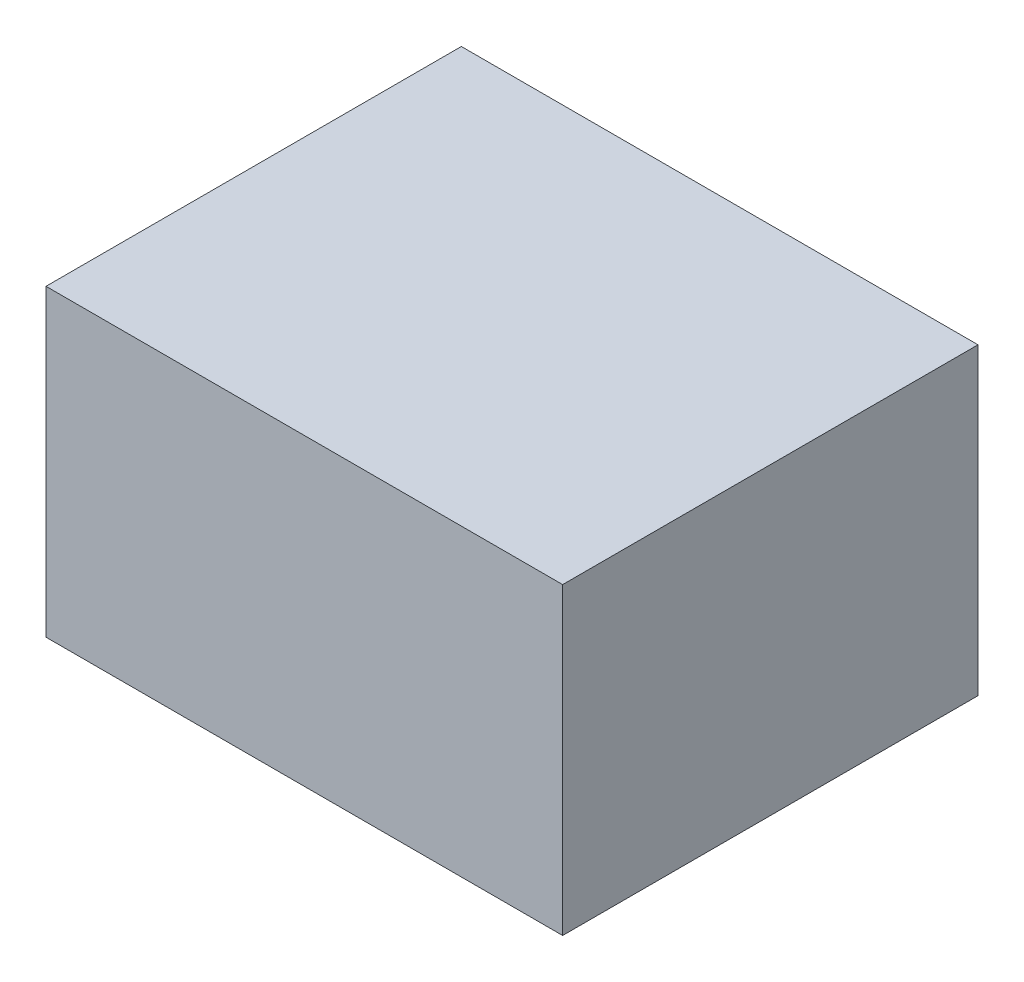
ISO-10303-21;
HEADER;
FILE_DESCRIPTION(('STEP AP214'),'2;1');
FILE_NAME('part.step','',(''),(''),'','','');
FILE_SCHEMA(('AUTOMOTIVE_DESIGN { 1 0 10303 214 1 1 1 1 }'));
ENDSEC;
DATA;
#1=APPLICATION_CONTEXT('core data for automotive mechanical design processes');
#2=APPLICATION_PROTOCOL_DEFINITION('international standard','automotive_design',2000,#1);
#3=PRODUCT_CONTEXT('',#1,'mechanical');
#4=PRODUCT('Part','Part','',(#3));
#5=PRODUCT_RELATED_PRODUCT_CATEGORY('part','',(#4));
#6=PRODUCT_DEFINITION_FORMATION('','',#4);
#7=PRODUCT_DEFINITION_CONTEXT('part definition',#1,'design');
#8=PRODUCT_DEFINITION('design','',#6,#7);
#9=PRODUCT_DEFINITION_SHAPE('','',#8);
#10=(LENGTH_UNIT() NAMED_UNIT(*) SI_UNIT(.MILLI.,.METRE.));
#11=(NAMED_UNIT(*) PLANE_ANGLE_UNIT() SI_UNIT($,.RADIAN.));
#12=(NAMED_UNIT(*) SI_UNIT($,.STERADIAN.) SOLID_ANGLE_UNIT());
#13=UNCERTAINTY_MEASURE_WITH_UNIT(LENGTH_MEASURE(1.E-05),#10,'distance_accuracy_value','');
#14=(GEOMETRIC_REPRESENTATION_CONTEXT(3) GLOBAL_UNCERTAINTY_ASSIGNED_CONTEXT((#13)) GLOBAL_UNIT_ASSIGNED_CONTEXT((#10,
#11,#12)) REPRESENTATION_CONTEXT('',''));
#15=CARTESIAN_POINT('',(0.,0.,0.));
#16=DIRECTION('',(0.,0.,1.));
#17=DIRECTION('',(1.,0.,0.));
#18=AXIS2_PLACEMENT_3D('',#15,#16,#17);
#19=CARTESIAN_POINT('',(0.,0.,0.));
#20=DIRECTION('',(0.,1.,0.));
#21=DIRECTION('',(0.,0.,1.));
#22=AXIS2_PLACEMENT_3D('',#19,#20,#21);
#23=PLANE('',#22);
#24=DIRECTION('',(0.,0.,-1.));
#25=VECTOR('',#24,1.);
#26=CARTESIAN_POINT('',(102.,0.,-81.9999999999999));
#27=LINE('',#26,#25);
#28=CARTESIAN_POINT('',(102.,0.,82.));
#29=VERTEX_POINT('',#28);
#30=CARTESIAN_POINT('',(102.,0.,-81.9999999999999));
#31=VERTEX_POINT('',#30);
#32=EDGE_CURVE('E143',#29,#31,#27,.T.);
#33=ORIENTED_EDGE('',*,*,#32,.F.);
#34=DIRECTION('',(1.,0.,0.));
#35=VECTOR('',#34,1.);
#36=CARTESIAN_POINT('',(-102.,0.,82.));
#37=LINE('',#36,#35);
#38=CARTESIAN_POINT('',(-102.,0.,82.));
#39=VERTEX_POINT('',#38);
#40=EDGE_CURVE('E91',#39,#29,#37,.T.);
#41=ORIENTED_EDGE('',*,*,#40,.F.);
#42=DIRECTION('',(0.,0.,1.));
#43=VECTOR('',#42,1.);
#44=CARTESIAN_POINT('',(-102.,0.,-81.9999999999999));
#45=LINE('',#44,#43);
#46=CARTESIAN_POINT('',(-102.,0.,-81.9999999999999));
#47=VERTEX_POINT('',#46);
#48=EDGE_CURVE('E168',#47,#39,#45,.T.);
#49=ORIENTED_EDGE('',*,*,#48,.F.);
#50=DIRECTION('',(-1.,0.,0.));
#51=VECTOR('',#50,1.);
#52=CARTESIAN_POINT('',(-102.,0.,-81.9999999999999));
#53=LINE('',#52,#51);
#54=EDGE_CURVE('E149',#31,#47,#53,.T.);
#55=ORIENTED_EDGE('',*,*,#54,.F.);
#56=EDGE_LOOP('',(#33,#41,#49,#55));
#57=FACE_BOUND('',#56,.T.);
#58=DIRECTION('',(0.,0.,-1.));
#59=VECTOR('',#58,1.);
#60=CARTESIAN_POINT('',(100.,0.,-80.));
#61=LINE('',#60,#59);
#62=CARTESIAN_POINT('',(100.,0.,80.));
#63=VERTEX_POINT('',#62);
#64=CARTESIAN_POINT('',(100.,0.,-80.));
#65=VERTEX_POINT('',#64);
#66=EDGE_CURVE('E61',#63,#65,#61,.T.);
#67=ORIENTED_EDGE('',*,*,#66,.T.);
#68=DIRECTION('',(-1.,0.,0.));
#69=VECTOR('',#68,1.);
#70=CARTESIAN_POINT('',(-100.,0.,-80.));
#71=LINE('',#70,#69);
#72=CARTESIAN_POINT('',(-100.,0.,-80.));
#73=VERTEX_POINT('',#72);
#74=EDGE_CURVE('E141',#65,#73,#71,.T.);
#75=ORIENTED_EDGE('',*,*,#74,.T.);
#76=DIRECTION('',(0.,0.,1.));
#77=VECTOR('',#76,1.);
#78=CARTESIAN_POINT('',(-100.,0.,-80.));
#79=LINE('',#78,#77);
#80=CARTESIAN_POINT('',(-100.,0.,80.));
#81=VERTEX_POINT('',#80);
#82=EDGE_CURVE('E288',#73,#81,#79,.T.);
#83=ORIENTED_EDGE('',*,*,#82,.T.);
#84=DIRECTION('',(1.,0.,0.));
#85=VECTOR('',#84,1.);
#86=CARTESIAN_POINT('',(-100.,0.,80.));
#87=LINE('',#86,#85);
#88=EDGE_CURVE('E137',#81,#63,#87,.T.);
#89=ORIENTED_EDGE('',*,*,#88,.T.);
#90=EDGE_LOOP('',(#67,#75,#83,#89));
#91=FACE_BOUND('',#90,.T.);
#92=ADVANCED_FACE('F45',(#57,#91),#23,.F.);
#93=CARTESIAN_POINT('',(102.,120.,-81.9999999999999));
#94=DIRECTION('',(-1.,0.,0.));
#95=DIRECTION('',(0.,0.,1.));
#96=AXIS2_PLACEMENT_3D('',#93,#94,#95);
#97=PLANE('',#96);
#98=ORIENTED_EDGE('',*,*,#32,.T.);
#99=DIRECTION('',(0.,-1.,0.));
#100=VECTOR('',#99,1.);
#101=CARTESIAN_POINT('',(102.,120.,-81.9999999999999));
#102=LINE('',#101,#100);
#103=CARTESIAN_POINT('',(102.,120.,-81.9999999999999));
#104=VERTEX_POINT('',#103);
#105=EDGE_CURVE('E11',#104,#31,#102,.T.);
#106=ORIENTED_EDGE('',*,*,#105,.F.);
#107=DIRECTION('',(0.,0.,-1.));
#108=VECTOR('',#107,1.);
#109=CARTESIAN_POINT('',(102.,120.,-81.9999999999999));
#110=LINE('',#109,#108);
#111=CARTESIAN_POINT('',(102.,120.,82.));
#112=VERTEX_POINT('',#111);
#113=EDGE_CURVE('E155',#112,#104,#110,.T.);
#114=ORIENTED_EDGE('',*,*,#113,.F.);
#115=DIRECTION('',(0.,-1.,0.));
#116=VECTOR('',#115,1.);
#117=CARTESIAN_POINT('',(102.,120.,82.));
#118=LINE('',#117,#116);
#119=EDGE_CURVE('E164',#112,#29,#118,.T.);
#120=ORIENTED_EDGE('',*,*,#119,.T.);
#121=EDGE_LOOP('',(#98,#106,#114,#120));
#122=FACE_BOUND('',#121,.T.);
#123=ADVANCED_FACE('F47',(#122),#97,.F.);
#124=CARTESIAN_POINT('',(-102.,120.,-81.9999999999999));
#125=DIRECTION('',(0.,0.,1.));
#126=DIRECTION('',(1.,0.,0.));
#127=AXIS2_PLACEMENT_3D('',#124,#125,#126);
#128=PLANE('',#127);
#129=ORIENTED_EDGE('',*,*,#54,.T.);
#130=DIRECTION('',(0.,-1.,0.));
#131=VECTOR('',#130,1.);
#132=CARTESIAN_POINT('',(-102.,120.,-81.9999999999999));
#133=LINE('',#132,#131);
#134=CARTESIAN_POINT('',(-102.,120.,-81.9999999999999));
#135=VERTEX_POINT('',#134);
#136=EDGE_CURVE('E54',#135,#47,#133,.T.);
#137=ORIENTED_EDGE('',*,*,#136,.F.);
#138=DIRECTION('',(-1.,0.,0.));
#139=VECTOR('',#138,1.);
#140=CARTESIAN_POINT('',(-102.,120.,-81.9999999999999));
#141=LINE('',#140,#139);
#142=EDGE_CURVE('E98',#104,#135,#141,.T.);
#143=ORIENTED_EDGE('',*,*,#142,.F.);
#144=ORIENTED_EDGE('',*,*,#105,.T.);
#145=EDGE_LOOP('',(#129,#137,#143,#144));
#146=FACE_BOUND('',#145,.T.);
#147=ADVANCED_FACE('F199',(#146),#128,.F.);
#148=CARTESIAN_POINT('',(-102.,120.,-81.9999999999999));
#149=DIRECTION('',(1.,0.,0.));
#150=DIRECTION('',(0.,0.,-1.));
#151=AXIS2_PLACEMENT_3D('',#148,#149,#150);
#152=PLANE('',#151);
#153=ORIENTED_EDGE('',*,*,#48,.T.);
#154=DIRECTION('',(0.,-1.,0.));
#155=VECTOR('',#154,1.);
#156=CARTESIAN_POINT('',(-102.,120.,82.));
#157=LINE('',#156,#155);
#158=CARTESIAN_POINT('',(-102.,120.,82.));
#159=VERTEX_POINT('',#158);
#160=EDGE_CURVE('E175',#159,#39,#157,.T.);
#161=ORIENTED_EDGE('',*,*,#160,.F.);
#162=DIRECTION('',(0.,0.,1.));
#163=VECTOR('',#162,1.);
#164=CARTESIAN_POINT('',(-102.,120.,-81.9999999999999));
#165=LINE('',#164,#163);
#166=EDGE_CURVE('E160',#135,#159,#165,.T.);
#167=ORIENTED_EDGE('',*,*,#166,.F.);
#168=ORIENTED_EDGE('',*,*,#136,.T.);
#169=EDGE_LOOP('',(#153,#161,#167,#168));
#170=FACE_BOUND('',#169,.T.);
#171=ADVANCED_FACE('F182',(#170),#152,.F.);
#172=CARTESIAN_POINT('',(-102.,120.,82.));
#173=DIRECTION('',(0.,0.,-1.));
#174=DIRECTION('',(-1.,0.,0.));
#175=AXIS2_PLACEMENT_3D('',#172,#173,#174);
#176=PLANE('',#175);
#177=ORIENTED_EDGE('',*,*,#40,.T.);
#178=ORIENTED_EDGE('',*,*,#119,.F.);
#179=DIRECTION('',(1.,0.,0.));
#180=VECTOR('',#179,1.);
#181=CARTESIAN_POINT('',(-102.,120.,82.));
#182=LINE('',#181,#180);
#183=EDGE_CURVE('E70',#159,#112,#182,.T.);
#184=ORIENTED_EDGE('',*,*,#183,.F.);
#185=ORIENTED_EDGE('',*,*,#160,.T.);
#186=EDGE_LOOP('',(#177,#178,#184,#185));
#187=FACE_BOUND('',#186,.T.);
#188=ADVANCED_FACE('F190',(#187),#176,.F.);
#189=CARTESIAN_POINT('',(0.,120.,0.));
#190=DIRECTION('',(0.,1.,0.));
#191=DIRECTION('',(0.,0.,1.));
#192=AXIS2_PLACEMENT_3D('',#189,#190,#191);
#193=PLANE('',#192);
#194=ORIENTED_EDGE('',*,*,#113,.T.);
#195=ORIENTED_EDGE('',*,*,#142,.T.);
#196=ORIENTED_EDGE('',*,*,#166,.T.);
#197=ORIENTED_EDGE('',*,*,#183,.T.);
#198=EDGE_LOOP('',(#194,#195,#196,#197));
#199=FACE_BOUND('',#198,.T.);
#200=ADVANCED_FACE('F192',(#199),#193,.T.);
#201=CARTESIAN_POINT('',(100.,116.,-80.));
#202=DIRECTION('',(-1.,0.,0.));
#203=DIRECTION('',(0.,0.,1.));
#204=AXIS2_PLACEMENT_3D('',#201,#202,#203);
#205=PLANE('',#204);
#206=ORIENTED_EDGE('',*,*,#66,.F.);
#207=DIRECTION('',(0.,-1.,0.));
#208=VECTOR('',#207,1.);
#209=CARTESIAN_POINT('',(100.,116.,80.));
#210=LINE('',#209,#208);
#211=CARTESIAN_POINT('',(100.,116.,80.));
#212=VERTEX_POINT('',#211);
#213=EDGE_CURVE('E135',#212,#63,#210,.T.);
#214=ORIENTED_EDGE('',*,*,#213,.F.);
#215=DIRECTION('',(0.,0.,-1.));
#216=VECTOR('',#215,1.);
#217=CARTESIAN_POINT('',(100.,116.,-80.));
#218=LINE('',#217,#216);
#219=CARTESIAN_POINT('',(100.,116.,-80.));
#220=VERTEX_POINT('',#219);
#221=EDGE_CURVE('E126',#212,#220,#218,.T.);
#222=ORIENTED_EDGE('',*,*,#221,.T.);
#223=DIRECTION('',(0.,-1.,0.));
#224=VECTOR('',#223,1.);
#225=CARTESIAN_POINT('',(100.,116.,-80.));
#226=LINE('',#225,#224);
#227=EDGE_CURVE('E134',#220,#65,#226,.T.);
#228=ORIENTED_EDGE('',*,*,#227,.T.);
#229=EDGE_LOOP('',(#206,#214,#222,#228));
#230=FACE_BOUND('',#229,.T.);
#231=ADVANCED_FACE('F133',(#230),#205,.T.);
#232=CARTESIAN_POINT('',(-100.,116.,-80.));
#233=DIRECTION('',(0.,0.,1.));
#234=DIRECTION('',(1.,0.,0.));
#235=AXIS2_PLACEMENT_3D('',#232,#233,#234);
#236=PLANE('',#235);
#237=ORIENTED_EDGE('',*,*,#74,.F.);
#238=ORIENTED_EDGE('',*,*,#227,.F.);
#239=DIRECTION('',(-1.,0.,0.));
#240=VECTOR('',#239,1.);
#241=CARTESIAN_POINT('',(-100.,116.,-80.));
#242=LINE('',#241,#240);
#243=CARTESIAN_POINT('',(-100.,116.,-80.));
#244=VERTEX_POINT('',#243);
#245=EDGE_CURVE('E122',#220,#244,#242,.T.);
#246=ORIENTED_EDGE('',*,*,#245,.T.);
#247=DIRECTION('',(0.,-1.,0.));
#248=VECTOR('',#247,1.);
#249=CARTESIAN_POINT('',(-100.,116.,-80.));
#250=LINE('',#249,#248);
#251=EDGE_CURVE('E144',#244,#73,#250,.T.);
#252=ORIENTED_EDGE('',*,*,#251,.T.);
#253=EDGE_LOOP('',(#237,#238,#246,#252));
#254=FACE_BOUND('',#253,.T.);
#255=ADVANCED_FACE('F139',(#254),#236,.T.);
#256=CARTESIAN_POINT('',(-100.,116.,-80.));
#257=DIRECTION('',(1.,0.,0.));
#258=DIRECTION('',(0.,0.,-1.));
#259=AXIS2_PLACEMENT_3D('',#256,#257,#258);
#260=PLANE('',#259);
#261=ORIENTED_EDGE('',*,*,#82,.F.);
#262=ORIENTED_EDGE('',*,*,#251,.F.);
#263=DIRECTION('',(0.,0.,1.));
#264=VECTOR('',#263,1.);
#265=CARTESIAN_POINT('',(-100.,116.,-80.));
#266=LINE('',#265,#264);
#267=CARTESIAN_POINT('',(-100.,116.,80.));
#268=VERTEX_POINT('',#267);
#269=EDGE_CURVE('E127',#244,#268,#266,.T.);
#270=ORIENTED_EDGE('',*,*,#269,.T.);
#271=DIRECTION('',(0.,-1.,0.));
#272=VECTOR('',#271,1.);
#273=CARTESIAN_POINT('',(-100.,116.,80.));
#274=LINE('',#273,#272);
#275=EDGE_CURVE('E151',#268,#81,#274,.T.);
#276=ORIENTED_EDGE('',*,*,#275,.T.);
#277=EDGE_LOOP('',(#261,#262,#270,#276));
#278=FACE_BOUND('',#277,.T.);
#279=ADVANCED_FACE('F211',(#278),#260,.T.);
#280=CARTESIAN_POINT('',(-100.,116.,80.));
#281=DIRECTION('',(0.,0.,-1.));
#282=DIRECTION('',(-1.,0.,0.));
#283=AXIS2_PLACEMENT_3D('',#280,#281,#282);
#284=PLANE('',#283);
#285=ORIENTED_EDGE('',*,*,#88,.F.);
#286=ORIENTED_EDGE('',*,*,#275,.F.);
#287=DIRECTION('',(1.,0.,0.));
#288=VECTOR('',#287,1.);
#289=CARTESIAN_POINT('',(-100.,116.,80.));
#290=LINE('',#289,#288);
#291=EDGE_CURVE('E298',#268,#212,#290,.T.);
#292=ORIENTED_EDGE('',*,*,#291,.T.);
#293=ORIENTED_EDGE('',*,*,#213,.T.);
#294=EDGE_LOOP('',(#285,#286,#292,#293));
#295=FACE_BOUND('',#294,.T.);
#296=ADVANCED_FACE('F214',(#295),#284,.T.);
#297=CARTESIAN_POINT('',(0.,116.,0.));
#298=DIRECTION('',(0.,1.,0.));
#299=DIRECTION('',(0.,0.,1.));
#300=AXIS2_PLACEMENT_3D('',#297,#298,#299);
#301=PLANE('',#300);
#302=ORIENTED_EDGE('',*,*,#221,.F.);
#303=ORIENTED_EDGE('',*,*,#291,.F.);
#304=ORIENTED_EDGE('',*,*,#269,.F.);
#305=ORIENTED_EDGE('',*,*,#245,.F.);
#306=EDGE_LOOP('',(#302,#303,#304,#305));
#307=FACE_BOUND('',#306,.T.);
#308=ADVANCED_FACE('F124',(#307),#301,.F.);
#309=CLOSED_SHELL('',(#92,#123,#147,#171,#188,#200,#231,#255,#279,#296,#308));
#310=MANIFOLD_SOLID_BREP('B2',#309);
#311=ADVANCED_BREP_SHAPE_REPRESENTATION('',(#18,#310),#14);
#312=SHAPE_DEFINITION_REPRESENTATION(#9,#311);
ENDSEC;
END-ISO-10303-21;
